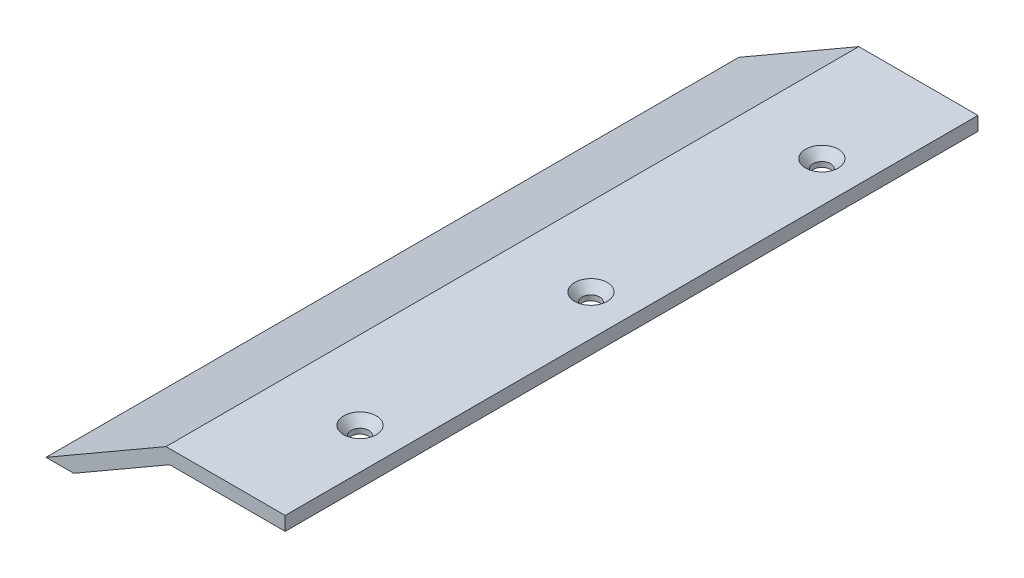
ISO-10303-21;
HEADER;
FILE_DESCRIPTION(('STEP AP214'),'2;1');
FILE_NAME('part.step','',(''),(''),'','','');
FILE_SCHEMA(('AUTOMOTIVE_DESIGN { 1 0 10303 214 1 1 1 1 }'));
ENDSEC;
DATA;
#1=APPLICATION_CONTEXT('core data for automotive mechanical design processes');
#2=APPLICATION_PROTOCOL_DEFINITION('international standard','automotive_design',2000,#1);
#3=PRODUCT_CONTEXT('',#1,'mechanical');
#4=PRODUCT('Part','Part','',(#3));
#5=PRODUCT_RELATED_PRODUCT_CATEGORY('part','',(#4));
#6=PRODUCT_DEFINITION_FORMATION('','',#4);
#7=PRODUCT_DEFINITION_CONTEXT('part definition',#1,'design');
#8=PRODUCT_DEFINITION('design','',#6,#7);
#9=PRODUCT_DEFINITION_SHAPE('','',#8);
#10=(LENGTH_UNIT() NAMED_UNIT(*) SI_UNIT(.MILLI.,.METRE.));
#11=(NAMED_UNIT(*) PLANE_ANGLE_UNIT() SI_UNIT($,.RADIAN.));
#12=(NAMED_UNIT(*) SI_UNIT($,.STERADIAN.) SOLID_ANGLE_UNIT());
#13=UNCERTAINTY_MEASURE_WITH_UNIT(LENGTH_MEASURE(1.E-05),#10,'distance_accuracy_value','');
#14=(GEOMETRIC_REPRESENTATION_CONTEXT(3) GLOBAL_UNCERTAINTY_ASSIGNED_CONTEXT((#13)) GLOBAL_UNIT_ASSIGNED_CONTEXT((#10,
#11,#12)) REPRESENTATION_CONTEXT('',''));
#15=CARTESIAN_POINT('',(0.,0.,0.));
#16=DIRECTION('',(0.,0.,1.));
#17=DIRECTION('',(1.,0.,0.));
#18=AXIS2_PLACEMENT_3D('',#15,#16,#17);
#19=CARTESIAN_POINT('',(25.,0.,75.));
#20=DIRECTION('',(0.,1.,0.));
#21=DIRECTION('',(-1.,0.,0.));
#22=AXIS2_PLACEMENT_3D('',#19,#20,#21);
#23=PLANE('',#22);
#24=CARTESIAN_POINT('',(16.1999999999998,0.,-50.));
#25=DIRECTION('',(0.,1.,0.));
#26=DIRECTION('',(-1.,0.,0.));
#27=AXIS2_PLACEMENT_3D('',#24,#25,#26);
#28=CIRCLE('',#27,1.89865);
#29=CARTESIAN_POINT('',(14.3013499999998,0.,-50.));
#30=VERTEX_POINT('',#29);
#31=EDGE_CURVE('E37',#30,#30,#28,.T.);
#32=ORIENTED_EDGE('',*,*,#31,.T.);
#33=EDGE_LOOP('',(#32));
#34=FACE_BOUND('',#33,.T.);
#35=CARTESIAN_POINT('',(16.2,0.,0.));
#36=DIRECTION('',(0.,1.,0.));
#37=DIRECTION('',(-1.,0.,0.));
#38=AXIS2_PLACEMENT_3D('',#35,#36,#37);
#39=CIRCLE('',#38,1.89865);
#40=CARTESIAN_POINT('',(14.30135,0.,0.));
#41=VERTEX_POINT('',#40);
#42=EDGE_CURVE('E139',#41,#41,#39,.T.);
#43=ORIENTED_EDGE('',*,*,#42,.T.);
#44=EDGE_LOOP('',(#43));
#45=FACE_BOUND('',#44,.T.);
#46=CARTESIAN_POINT('',(16.2000000000005,0.,50.));
#47=DIRECTION('',(0.,1.,0.));
#48=DIRECTION('',(-1.,0.,0.));
#49=AXIS2_PLACEMENT_3D('',#46,#47,#48);
#50=CIRCLE('',#49,1.89865);
#51=CARTESIAN_POINT('',(14.3013500000005,0.,50.));
#52=VERTEX_POINT('',#51);
#53=EDGE_CURVE('E124',#52,#52,#50,.T.);
#54=ORIENTED_EDGE('',*,*,#53,.T.);
#55=EDGE_LOOP('',(#54));
#56=FACE_BOUND('',#55,.T.);
#57=DIRECTION('',(1.,0.,0.));
#58=VECTOR('',#57,1.);
#59=CARTESIAN_POINT('',(25.,0.,-75.));
#60=LINE('',#59,#58);
#61=CARTESIAN_POINT('',(0.,0.,-75.));
#62=VERTEX_POINT('',#61);
#63=CARTESIAN_POINT('',(25.,0.,-75.));
#64=VERTEX_POINT('',#63);
#65=EDGE_CURVE('E120',#62,#64,#60,.T.);
#66=ORIENTED_EDGE('',*,*,#65,.T.);
#67=DIRECTION('',(0.,0.,-1.));
#68=VECTOR('',#67,1.);
#69=CARTESIAN_POINT('',(25.,0.,75.));
#70=LINE('',#69,#68);
#71=CARTESIAN_POINT('',(25.,0.,75.));
#72=VERTEX_POINT('',#71);
#73=EDGE_CURVE('E11',#72,#64,#70,.T.);
#74=ORIENTED_EDGE('',*,*,#73,.F.);
#75=DIRECTION('',(1.,0.,0.));
#76=VECTOR('',#75,1.);
#77=CARTESIAN_POINT('',(25.,0.,75.));
#78=LINE('',#77,#76);
#79=CARTESIAN_POINT('',(0.,0.,75.));
#80=VERTEX_POINT('',#79);
#81=EDGE_CURVE('E131',#80,#72,#78,.T.);
#82=ORIENTED_EDGE('',*,*,#81,.F.);
#83=DIRECTION('',(0.,0.,-1.));
#84=VECTOR('',#83,1.);
#85=CARTESIAN_POINT('',(0.,0.,75.));
#86=LINE('',#85,#84);
#87=EDGE_CURVE('E116',#80,#62,#86,.T.);
#88=ORIENTED_EDGE('',*,*,#87,.T.);
#89=EDGE_LOOP('',(#66,#74,#82,#88));
#90=FACE_BOUND('',#89,.T.);
#91=ADVANCED_FACE('F34',(#34,#45,#56,#90),#23,.F.);
#92=CARTESIAN_POINT('',(25.,0.,75.));
#93=DIRECTION('',(-1.,0.,0.));
#94=DIRECTION('',(0.,0.,1.));
#95=AXIS2_PLACEMENT_3D('',#92,#93,#94);
#96=PLANE('',#95);
#97=DIRECTION('',(0.,1.,0.));
#98=VECTOR('',#97,1.);
#99=CARTESIAN_POINT('',(25.,0.,-75.));
#100=LINE('',#99,#98);
#101=CARTESIAN_POINT('',(25.,3.,-75.));
#102=VERTEX_POINT('',#101);
#103=EDGE_CURVE('E123',#64,#102,#100,.T.);
#104=ORIENTED_EDGE('',*,*,#103,.T.);
#105=DIRECTION('',(0.,0.,-1.));
#106=VECTOR('',#105,1.);
#107=CARTESIAN_POINT('',(25.,3.,75.));
#108=LINE('',#107,#106);
#109=CARTESIAN_POINT('',(25.,3.,75.));
#110=VERTEX_POINT('',#109);
#111=EDGE_CURVE('E43',#110,#102,#108,.T.);
#112=ORIENTED_EDGE('',*,*,#111,.F.);
#113=DIRECTION('',(0.,1.,0.));
#114=VECTOR('',#113,1.);
#115=CARTESIAN_POINT('',(25.,0.,75.));
#116=LINE('',#115,#114);
#117=EDGE_CURVE('E89',#72,#110,#116,.T.);
#118=ORIENTED_EDGE('',*,*,#117,.F.);
#119=ORIENTED_EDGE('',*,*,#73,.T.);
#120=EDGE_LOOP('',(#104,#112,#118,#119));
#121=FACE_BOUND('',#120,.T.);
#122=ADVANCED_FACE('F161',(#121),#96,.F.);
#123=CARTESIAN_POINT('',(25.,3.,75.));
#124=DIRECTION('',(0.,-1.,0.));
#125=DIRECTION('',(1.,0.,0.));
#126=AXIS2_PLACEMENT_3D('',#123,#124,#125);
#127=PLANE('',#126);
#128=CARTESIAN_POINT('',(16.1999999999998,3.,-50.));
#129=DIRECTION('',(0.,1.,0.));
#130=DIRECTION('',(0.,0.,1.));
#131=AXIS2_PLACEMENT_3D('',#128,#129,#130);
#132=CIRCLE('',#131,3.5433);
#133=CARTESIAN_POINT('',(16.1999999999998,3.,-46.4567));
#134=VERTEX_POINT('',#133);
#135=EDGE_CURVE('E223',#134,#134,#132,.T.);
#136=ORIENTED_EDGE('',*,*,#135,.F.);
#137=EDGE_LOOP('',(#136));
#138=FACE_BOUND('',#137,.T.);
#139=CARTESIAN_POINT('',(16.2,3.,0.));
#140=DIRECTION('',(0.,1.,0.));
#141=DIRECTION('',(0.,0.,1.));
#142=AXIS2_PLACEMENT_3D('',#139,#140,#141);
#143=CIRCLE('',#142,3.5433);
#144=CARTESIAN_POINT('',(16.2,3.,3.5433));
#145=VERTEX_POINT('',#144);
#146=EDGE_CURVE('E148',#145,#145,#143,.T.);
#147=ORIENTED_EDGE('',*,*,#146,.F.);
#148=EDGE_LOOP('',(#147));
#149=FACE_BOUND('',#148,.T.);
#150=CARTESIAN_POINT('',(16.2000000000005,3.,50.));
#151=DIRECTION('',(0.,1.,0.));
#152=DIRECTION('',(0.,0.,1.));
#153=AXIS2_PLACEMENT_3D('',#150,#151,#152);
#154=CIRCLE('',#153,3.5433);
#155=CARTESIAN_POINT('',(16.2000000000005,3.,53.5433));
#156=VERTEX_POINT('',#155);
#157=EDGE_CURVE('E141',#156,#156,#154,.T.);
#158=ORIENTED_EDGE('',*,*,#157,.F.);
#159=EDGE_LOOP('',(#158));
#160=FACE_BOUND('',#159,.T.);
#161=DIRECTION('',(-1.,0.,0.));
#162=VECTOR('',#161,1.);
#163=CARTESIAN_POINT('',(25.,3.,-75.));
#164=LINE('',#163,#162);
#165=CARTESIAN_POINT('',(-0.803847577293369,3.,-75.));
#166=VERTEX_POINT('',#165);
#167=EDGE_CURVE('E126',#102,#166,#164,.T.);
#168=ORIENTED_EDGE('',*,*,#167,.T.);
#169=DIRECTION('',(0.,0.,-1.));
#170=VECTOR('',#169,1.);
#171=CARTESIAN_POINT('',(-0.803847577293369,3.,75.));
#172=LINE('',#171,#170);
#173=CARTESIAN_POINT('',(-0.803847577293369,3.,75.));
#174=VERTEX_POINT('',#173);
#175=EDGE_CURVE('E111',#174,#166,#172,.T.);
#176=ORIENTED_EDGE('',*,*,#175,.F.);
#177=DIRECTION('',(-1.,0.,0.));
#178=VECTOR('',#177,1.);
#179=CARTESIAN_POINT('',(25.,3.,75.));
#180=LINE('',#179,#178);
#181=EDGE_CURVE('E102',#110,#174,#180,.T.);
#182=ORIENTED_EDGE('',*,*,#181,.F.);
#183=ORIENTED_EDGE('',*,*,#111,.T.);
#184=EDGE_LOOP('',(#168,#176,#182,#183));
#185=FACE_BOUND('',#184,.T.);
#186=ADVANCED_FACE('F164',(#138,#149,#160,#185),#127,.F.);
#187=CARTESIAN_POINT('',(-0.803847577293369,3.,75.));
#188=DIRECTION('',(0.499999999999995,-0.866025403784441,0.));
#189=DIRECTION('',(0.866025403784441,0.499999999999995,0.));
#190=AXIS2_PLACEMENT_3D('',#187,#188,#189);
#191=PLANE('',#190);
#192=DIRECTION('',(-0.866025403784442,-0.499999999999995,0.));
#193=VECTOR('',#192,1.);
#194=CARTESIAN_POINT('',(-0.803847577293369,3.,-75.));
#195=LINE('',#194,#193);
#196=CARTESIAN_POINT('',(-26.7846096908269,-12.,-75.));
#197=VERTEX_POINT('',#196);
#198=EDGE_CURVE('E110',#166,#197,#195,.T.);
#199=ORIENTED_EDGE('',*,*,#198,.T.);
#200=DIRECTION('',(0.,0.,-1.));
#201=VECTOR('',#200,1.);
#202=CARTESIAN_POINT('',(-26.7846096908269,-12.,75.));
#203=LINE('',#202,#201);
#204=CARTESIAN_POINT('',(-26.7846096908269,-12.,75.));
#205=VERTEX_POINT('',#204);
#206=EDGE_CURVE('E107',#205,#197,#203,.T.);
#207=ORIENTED_EDGE('',*,*,#206,.F.);
#208=DIRECTION('',(-0.866025403784442,-0.499999999999995,0.));
#209=VECTOR('',#208,1.);
#210=CARTESIAN_POINT('',(-0.803847577293369,3.,75.));
#211=LINE('',#210,#209);
#212=EDGE_CURVE('E96',#174,#205,#211,.T.);
#213=ORIENTED_EDGE('',*,*,#212,.F.);
#214=ORIENTED_EDGE('',*,*,#175,.T.);
#215=EDGE_LOOP('',(#199,#207,#213,#214));
#216=FACE_BOUND('',#215,.T.);
#217=ADVANCED_FACE('F108',(#216),#191,.F.);
#218=CARTESIAN_POINT('',(-26.7846096908269,-12.,75.));
#219=DIRECTION('',(0.,1.,0.));
#220=DIRECTION('',(-1.,0.,0.));
#221=AXIS2_PLACEMENT_3D('',#218,#219,#220);
#222=PLANE('',#221);
#223=DIRECTION('',(1.,0.,0.));
#224=VECTOR('',#223,1.);
#225=CARTESIAN_POINT('',(-26.7846096908269,-12.,-75.));
#226=LINE('',#225,#224);
#227=CARTESIAN_POINT('',(-20.7846096908268,-12.,-75.));
#228=VERTEX_POINT('',#227);
#229=EDGE_CURVE('E75',#197,#228,#226,.T.);
#230=ORIENTED_EDGE('',*,*,#229,.T.);
#231=DIRECTION('',(0.,0.,-1.));
#232=VECTOR('',#231,1.);
#233=CARTESIAN_POINT('',(-20.7846096908268,-12.,75.));
#234=LINE('',#233,#232);
#235=CARTESIAN_POINT('',(-20.7846096908268,-12.,75.));
#236=VERTEX_POINT('',#235);
#237=EDGE_CURVE('E112',#236,#228,#234,.T.);
#238=ORIENTED_EDGE('',*,*,#237,.F.);
#239=DIRECTION('',(1.,0.,0.));
#240=VECTOR('',#239,1.);
#241=CARTESIAN_POINT('',(-26.7846096908269,-12.,75.));
#242=LINE('',#241,#240);
#243=EDGE_CURVE('E100',#205,#236,#242,.T.);
#244=ORIENTED_EDGE('',*,*,#243,.F.);
#245=ORIENTED_EDGE('',*,*,#206,.T.);
#246=EDGE_LOOP('',(#230,#238,#244,#245));
#247=FACE_BOUND('',#246,.T.);
#248=ADVANCED_FACE('F114',(#247),#222,.F.);
#249=CARTESIAN_POINT('',(-20.7846096908268,-12.,75.));
#250=DIRECTION('',(-0.499999999999995,0.866025403784442,0.));
#251=DIRECTION('',(-0.866025403784442,-0.499999999999995,0.));
#252=AXIS2_PLACEMENT_3D('',#249,#250,#251);
#253=PLANE('',#252);
#254=DIRECTION('',(0.866025403784442,0.499999999999995,0.));
#255=VECTOR('',#254,1.);
#256=CARTESIAN_POINT('',(-20.7846096908268,-12.,-75.));
#257=LINE('',#256,#255);
#258=EDGE_CURVE('E81',#228,#62,#257,.T.);
#259=ORIENTED_EDGE('',*,*,#258,.T.);
#260=ORIENTED_EDGE('',*,*,#87,.F.);
#261=DIRECTION('',(0.866025403784442,0.499999999999995,0.));
#262=VECTOR('',#261,1.);
#263=CARTESIAN_POINT('',(-20.7846096908268,-12.,75.));
#264=LINE('',#263,#262);
#265=EDGE_CURVE('E52',#236,#80,#264,.T.);
#266=ORIENTED_EDGE('',*,*,#265,.F.);
#267=ORIENTED_EDGE('',*,*,#237,.T.);
#268=EDGE_LOOP('',(#259,#260,#266,#267));
#269=FACE_BOUND('',#268,.T.);
#270=ADVANCED_FACE('F169',(#269),#253,.F.);
#271=CARTESIAN_POINT('',(0.,0.,75.));
#272=DIRECTION('',(0.,0.,-1.));
#273=DIRECTION('',(-1.,0.,0.));
#274=AXIS2_PLACEMENT_3D('',#271,#272,#273);
#275=PLANE('',#274);
#276=ORIENTED_EDGE('',*,*,#81,.T.);
#277=ORIENTED_EDGE('',*,*,#117,.T.);
#278=ORIENTED_EDGE('',*,*,#181,.T.);
#279=ORIENTED_EDGE('',*,*,#212,.T.);
#280=ORIENTED_EDGE('',*,*,#243,.T.);
#281=ORIENTED_EDGE('',*,*,#265,.T.);
#282=EDGE_LOOP('',(#276,#277,#278,#279,#280,#281));
#283=FACE_BOUND('',#282,.T.);
#284=ADVANCED_FACE('F98',(#283),#275,.F.);
#285=CARTESIAN_POINT('',(0.,0.,-75.));
#286=DIRECTION('',(0.,0.,-1.));
#287=DIRECTION('',(-1.,0.,0.));
#288=AXIS2_PLACEMENT_3D('',#285,#286,#287);
#289=PLANE('',#288);
#290=ORIENTED_EDGE('',*,*,#65,.F.);
#291=ORIENTED_EDGE('',*,*,#258,.F.);
#292=ORIENTED_EDGE('',*,*,#229,.F.);
#293=ORIENTED_EDGE('',*,*,#198,.F.);
#294=ORIENTED_EDGE('',*,*,#167,.F.);
#295=ORIENTED_EDGE('',*,*,#103,.F.);
#296=EDGE_LOOP('',(#290,#291,#292,#293,#294,#295));
#297=FACE_BOUND('',#296,.T.);
#298=ADVANCED_FACE('F167',(#297),#289,.T.);
#299=CARTESIAN_POINT('',(16.2000000000005,3.,50.));
#300=DIRECTION('',(0.,1.,0.));
#301=DIRECTION('',(0.,0.,1.));
#302=AXIS2_PLACEMENT_3D('',#299,#300,#301);
#303=CYLINDRICAL_SURFACE('',#302,1.89865);
#304=CARTESIAN_POINT('',(16.2000000000005,1.10804659906397,50.));
#305=DIRECTION('',(0.,1.,0.));
#306=DIRECTION('',(0.,0.,1.));
#307=AXIS2_PLACEMENT_3D('',#304,#305,#306);
#308=CIRCLE('',#307,1.89865);
#309=CARTESIAN_POINT('',(16.2000000000005,1.10804659906397,51.89865));
#310=VERTEX_POINT('',#309);
#311=EDGE_CURVE('E138',#310,#310,#308,.T.);
#312=ORIENTED_EDGE('',*,*,#311,.T.);
#313=EDGE_LOOP('',(#312));
#314=FACE_BOUND('',#313,.T.);
#315=ORIENTED_EDGE('',*,*,#53,.F.);
#316=EDGE_LOOP('',(#315));
#317=FACE_BOUND('',#316,.T.);
#318=ADVANCED_FACE('F189',(#314,#317),#303,.F.);
#319=CARTESIAN_POINT('',(16.2000000000005,3.,50.));
#320=DIRECTION('',(0.,1.,0.));
#321=DIRECTION('',(0.,0.,1.));
#322=AXIS2_PLACEMENT_3D('',#319,#320,#321);
#323=CONICAL_SURFACE('',#322,3.5433,0.715584993317676);
#324=ORIENTED_EDGE('',*,*,#311,.F.);
#325=EDGE_LOOP('',(#324));
#326=FACE_BOUND('',#325,.T.);
#327=ORIENTED_EDGE('',*,*,#157,.T.);
#328=EDGE_LOOP('',(#327));
#329=FACE_BOUND('',#328,.T.);
#330=ADVANCED_FACE('F191',(#326,#329),#323,.F.);
#331=CARTESIAN_POINT('',(16.2,3.,0.));
#332=DIRECTION('',(0.,1.,0.));
#333=DIRECTION('',(0.,0.,1.));
#334=AXIS2_PLACEMENT_3D('',#331,#332,#333);
#335=CYLINDRICAL_SURFACE('',#334,1.89865);
#336=CARTESIAN_POINT('',(16.2,1.10804659906397,0.));
#337=DIRECTION('',(0.,1.,0.));
#338=DIRECTION('',(0.,0.,1.));
#339=AXIS2_PLACEMENT_3D('',#336,#337,#338);
#340=CIRCLE('',#339,1.89865);
#341=CARTESIAN_POINT('',(16.2,1.10804659906397,1.89865));
#342=VERTEX_POINT('',#341);
#343=EDGE_CURVE('E142',#342,#342,#340,.T.);
#344=ORIENTED_EDGE('',*,*,#343,.T.);
#345=EDGE_LOOP('',(#344));
#346=FACE_BOUND('',#345,.T.);
#347=ORIENTED_EDGE('',*,*,#42,.F.);
#348=EDGE_LOOP('',(#347));
#349=FACE_BOUND('',#348,.T.);
#350=ADVANCED_FACE('F198',(#346,#349),#335,.F.);
#351=CARTESIAN_POINT('',(16.2,3.,0.));
#352=DIRECTION('',(0.,1.,0.));
#353=DIRECTION('',(0.,0.,1.));
#354=AXIS2_PLACEMENT_3D('',#351,#352,#353);
#355=CONICAL_SURFACE('',#354,3.5433,0.715584993317676);
#356=ORIENTED_EDGE('',*,*,#343,.F.);
#357=EDGE_LOOP('',(#356));
#358=FACE_BOUND('',#357,.T.);
#359=ORIENTED_EDGE('',*,*,#146,.T.);
#360=EDGE_LOOP('',(#359));
#361=FACE_BOUND('',#360,.T.);
#362=ADVANCED_FACE('F204',(#358,#361),#355,.F.);
#363=CARTESIAN_POINT('',(16.1999999999998,3.,-50.));
#364=DIRECTION('',(0.,1.,0.));
#365=DIRECTION('',(0.,0.,1.));
#366=AXIS2_PLACEMENT_3D('',#363,#364,#365);
#367=CYLINDRICAL_SURFACE('',#366,1.89865);
#368=CARTESIAN_POINT('',(16.1999999999998,1.10804659906397,-50.));
#369=DIRECTION('',(0.,1.,0.));
#370=DIRECTION('',(0.,0.,1.));
#371=AXIS2_PLACEMENT_3D('',#368,#369,#370);
#372=CIRCLE('',#371,1.89865);
#373=CARTESIAN_POINT('',(16.1999999999998,1.10804659906397,-48.10135));
#374=VERTEX_POINT('',#373);
#375=EDGE_CURVE('E220',#374,#374,#372,.T.);
#376=ORIENTED_EDGE('',*,*,#375,.T.);
#377=EDGE_LOOP('',(#376));
#378=FACE_BOUND('',#377,.T.);
#379=ORIENTED_EDGE('',*,*,#31,.F.);
#380=EDGE_LOOP('',(#379));
#381=FACE_BOUND('',#380,.T.);
#382=ADVANCED_FACE('F207',(#378,#381),#367,.F.);
#383=CARTESIAN_POINT('',(16.1999999999998,3.,-50.));
#384=DIRECTION('',(0.,1.,0.));
#385=DIRECTION('',(0.,0.,1.));
#386=AXIS2_PLACEMENT_3D('',#383,#384,#385);
#387=CONICAL_SURFACE('',#386,3.5433,0.715584993317676);
#388=ORIENTED_EDGE('',*,*,#375,.F.);
#389=EDGE_LOOP('',(#388));
#390=FACE_BOUND('',#389,.T.);
#391=ORIENTED_EDGE('',*,*,#135,.T.);
#392=EDGE_LOOP('',(#391));
#393=FACE_BOUND('',#392,.T.);
#394=ADVANCED_FACE('F211',(#390,#393),#387,.F.);
#395=CLOSED_SHELL('',(#91,#122,#186,#217,#248,#270,#284,#298,#318,#330,#350,#362,#382,#394));
#396=MANIFOLD_SOLID_BREP('B2',#395);
#397=ADVANCED_BREP_SHAPE_REPRESENTATION('',(#18,#396),#14);
#398=SHAPE_DEFINITION_REPRESENTATION(#9,#397);
ENDSEC;
END-ISO-10303-21;
